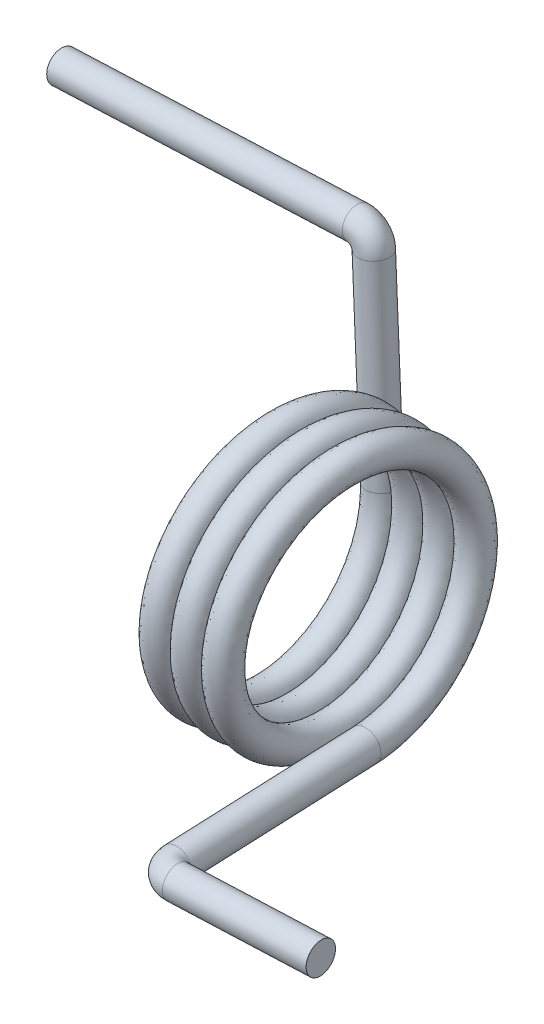
ISO-10303-21;
HEADER;
FILE_DESCRIPTION(('STEP AP214'),'2;1');
FILE_NAME('part.step','',(''),(''),'','','');
FILE_SCHEMA(('AUTOMOTIVE_DESIGN { 1 0 10303 214 1 1 1 1 }'));
ENDSEC;
DATA;
#1=APPLICATION_CONTEXT('core data for automotive mechanical design processes');
#2=APPLICATION_PROTOCOL_DEFINITION('international standard','automotive_design',2000,#1);
#3=PRODUCT_CONTEXT('',#1,'mechanical');
#4=PRODUCT('Part','Part','',(#3));
#5=PRODUCT_RELATED_PRODUCT_CATEGORY('part','',(#4));
#6=PRODUCT_DEFINITION_FORMATION('','',#4);
#7=PRODUCT_DEFINITION_CONTEXT('part definition',#1,'design');
#8=PRODUCT_DEFINITION('design','',#6,#7);
#9=PRODUCT_DEFINITION_SHAPE('','',#8);
#10=(LENGTH_UNIT() NAMED_UNIT(*) SI_UNIT(.MILLI.,.METRE.));
#11=(NAMED_UNIT(*) PLANE_ANGLE_UNIT() SI_UNIT($,.RADIAN.));
#12=(NAMED_UNIT(*) SI_UNIT($,.STERADIAN.) SOLID_ANGLE_UNIT());
#13=UNCERTAINTY_MEASURE_WITH_UNIT(LENGTH_MEASURE(1.E-05),#10,'distance_accuracy_value','');
#14=(GEOMETRIC_REPRESENTATION_CONTEXT(3) GLOBAL_UNCERTAINTY_ASSIGNED_CONTEXT((#13)) GLOBAL_UNIT_ASSIGNED_CONTEXT((#10,
#11,#12)) REPRESENTATION_CONTEXT('',''));
#15=CARTESIAN_POINT('',(0.,0.,0.));
#16=DIRECTION('',(0.,0.,1.));
#17=DIRECTION('',(1.,0.,0.));
#18=AXIS2_PLACEMENT_3D('',#15,#16,#17);
#19=CARTESIAN_POINT('',(0.989731142426947,0.0414804256276324,-7.62));
#20=CARTESIAN_POINT('',(1.15694780909361,-4.35792862559731,-7.64394873490221));
#21=CARTESIAN_POINT('',(1.32416447576028,-6.57837336402361,-3.84592310235332));
#22=CARTESIAN_POINT('',(1.49138114242695,-8.7988181024499,-0.0478974698044282));
#23=CARTESIAN_POINT('',(1.65859780909361,-6.61985378965124,3.77407689764668));
#24=CARTESIAN_POINT('',(1.82581447576028,-4.44088947685258,7.59605126509778));
#25=CARTESIAN_POINT('',(1.99303114242694,-0.0414804256276333,7.62));
#26=CARTESIAN_POINT('',(2.16024780909361,4.35792862559731,7.64394873490222));
#27=CARTESIAN_POINT('',(2.32746447576028,6.5783733640236,3.84592310235332));
#28=CARTESIAN_POINT('',(2.49468114242694,8.7988181024499,0.0478974698044293));
#29=CARTESIAN_POINT('',(2.66189780909361,6.61985378965124,-3.77407689764667));
#30=CARTESIAN_POINT('',(2.82911447576028,4.44088947685258,-7.59605126509778));
#31=CARTESIAN_POINT('',(2.99633114242694,0.0414804256276324,-7.62));
#32=CARTESIAN_POINT('',(3.16354780909361,-4.35792862559731,-7.64394873490221));
#33=CARTESIAN_POINT('',(3.33076447576028,-6.57837336402361,-3.84592310235332));
#34=CARTESIAN_POINT('',(3.49798114242694,-8.7988181024499,-0.0478974698044282));
#35=CARTESIAN_POINT('',(3.66519780909361,-6.61985378965124,3.77407689764668));
#36=CARTESIAN_POINT('',(3.83241447576027,-4.44088947685258,7.59605126509778));
#37=CARTESIAN_POINT('',(3.99963114242694,-0.0414804256276333,7.62));
#38=CARTESIAN_POINT('',(4.16684780909361,4.35792862559731,7.64394873490222));
#39=CARTESIAN_POINT('',(4.33406447576027,6.5783733640236,3.84592310235332));
#40=CARTESIAN_POINT('',(4.50128114242694,8.7988181024499,0.0478974698044293));
#41=CARTESIAN_POINT('',(4.6684978090936,6.61985378965124,-3.77407689764667));
#42=CARTESIAN_POINT('',(4.83571447576027,4.44088947685258,-7.59605126509778));
#43=CARTESIAN_POINT('',(5.00293114242694,0.0414804256276324,-7.62));
#44=CARTESIAN_POINT('',(5.1701478090936,-4.35792862559731,-7.64394873490221));
#45=CARTESIAN_POINT('',(5.33736447576027,-6.57837336402361,-3.84592310235332));
#46=CARTESIAN_POINT('',(5.50458114242694,-8.7988181024499,-0.0478974698044282));
#47=CARTESIAN_POINT('',(5.6717978090936,-6.61985378965124,3.77407689764668));
#48=CARTESIAN_POINT('',(5.83901447576027,-4.44088947685258,7.59605126509778));
#49=CARTESIAN_POINT('',(6.00623114242694,-0.0414804256276333,7.62));
#50=CARTESIAN_POINT('',(6.1734478090936,4.35792862559731,7.64394873490222));
#51=CARTESIAN_POINT('',(6.34066447576027,6.5783733640236,3.84592310235332));
#52=CARTESIAN_POINT('',(6.50788114242693,8.7988181024499,0.0478974698044293));
#53=CARTESIAN_POINT('',(6.6750978090936,6.61985378965124,-3.77407689764667));
#54=CARTESIAN_POINT('',(6.84231447576027,4.44088947685258,-7.59605126509778));
#55=CARTESIAN_POINT('',(7.00953114242693,0.0414804256276324,-7.62));
#56=CARTESIAN_POINT('',(7.1767478090936,-4.35792862559731,-7.64394873490221));
#57=CARTESIAN_POINT('',(7.34396447576027,-6.57837336402361,-3.84592310235332));
#58=CARTESIAN_POINT('',(7.51118114242693,-8.7988181024499,-0.0478974698044282));
#59=CARTESIAN_POINT('',(7.6783978090936,-6.61985378965124,3.77407689764668));
#60=CARTESIAN_POINT('',(7.84561447576026,-4.44088947685258,7.59605126509778));
#61=CARTESIAN_POINT('',(8.01283114242693,-0.0414804256276333,7.62));
#62=CARTESIAN_POINT('',(8.1800478090936,4.35792862559731,7.64394873490222));
#63=CARTESIAN_POINT('',(8.34726447576026,6.5783733640236,3.84592310235332));
#64=CARTESIAN_POINT('',(8.51448114242693,8.7988181024499,0.0478974698044293));
#65=CARTESIAN_POINT('',(8.6816978090936,6.61985378965124,-3.77407689764667));
#66=CARTESIAN_POINT('',(8.84891447576026,4.44088947685258,-7.59605126509778));
#67=CARTESIAN_POINT('',(9.01613114242693,0.0414804256276324,-7.62));
#68=CARTESIAN_POINT('',(0.989731142426947,0.0414804256276324,-5.6388));
#69=CARTESIAN_POINT('',(1.15694780909361,-3.21408227227883,-5.66274873490222));
#70=CARTESIAN_POINT('',(1.32416447576028,-4.86260383404588,-2.85532310235332));
#71=CARTESIAN_POINT('',(1.49138114242695,-6.51112539581292,-0.047897469804428));
#72=CARTESIAN_POINT('',(1.65859780909361,-4.90408425967351,2.78347689764668));
#73=CARTESIAN_POINT('',(1.82581447576028,-3.2970431235341,5.61485126509779));
#74=CARTESIAN_POINT('',(1.99303114242694,-0.0414804256276331,5.6388));
#75=CARTESIAN_POINT('',(2.16024780909361,3.21408227227883,5.66274873490222));
#76=CARTESIAN_POINT('',(2.32746447576028,4.86260383404588,2.85532310235332));
#77=CARTESIAN_POINT('',(2.49468114242694,6.51112539581292,0.0478974698044288));
#78=CARTESIAN_POINT('',(2.66189780909361,4.90408425967351,-2.78347689764668));
#79=CARTESIAN_POINT('',(2.82911447576028,3.2970431235341,-5.61485126509779));
#80=CARTESIAN_POINT('',(2.99633114242694,0.0414804256276324,-5.6388));
#81=CARTESIAN_POINT('',(3.16354780909361,-3.21408227227883,-5.66274873490222));
#82=CARTESIAN_POINT('',(3.33076447576028,-4.86260383404588,-2.85532310235332));
#83=CARTESIAN_POINT('',(3.49798114242694,-6.51112539581292,-0.047897469804428));
#84=CARTESIAN_POINT('',(3.66519780909361,-4.90408425967351,2.78347689764668));
#85=CARTESIAN_POINT('',(3.83241447576027,-3.2970431235341,5.61485126509779));
#86=CARTESIAN_POINT('',(3.99963114242694,-0.0414804256276331,5.6388));
#87=CARTESIAN_POINT('',(4.16684780909361,3.21408227227883,5.66274873490222));
#88=CARTESIAN_POINT('',(4.33406447576027,4.86260383404588,2.85532310235332));
#89=CARTESIAN_POINT('',(4.50128114242694,6.51112539581292,0.0478974698044288));
#90=CARTESIAN_POINT('',(4.6684978090936,4.90408425967351,-2.78347689764668));
#91=CARTESIAN_POINT('',(4.83571447576027,3.2970431235341,-5.61485126509779));
#92=CARTESIAN_POINT('',(5.00293114242694,0.0414804256276324,-5.6388));
#93=CARTESIAN_POINT('',(5.1701478090936,-3.21408227227883,-5.66274873490222));
#94=CARTESIAN_POINT('',(5.33736447576027,-4.86260383404588,-2.85532310235332));
#95=CARTESIAN_POINT('',(5.50458114242694,-6.51112539581292,-0.047897469804428));
#96=CARTESIAN_POINT('',(5.6717978090936,-4.90408425967351,2.78347689764668));
#97=CARTESIAN_POINT('',(5.83901447576027,-3.2970431235341,5.61485126509779));
#98=CARTESIAN_POINT('',(6.00623114242694,-0.0414804256276331,5.6388));
#99=CARTESIAN_POINT('',(6.1734478090936,3.21408227227883,5.66274873490222));
#100=CARTESIAN_POINT('',(6.34066447576027,4.86260383404588,2.85532310235332));
#101=CARTESIAN_POINT('',(6.50788114242693,6.51112539581292,0.0478974698044288));
#102=CARTESIAN_POINT('',(6.6750978090936,4.90408425967351,-2.78347689764668));
#103=CARTESIAN_POINT('',(6.84231447576027,3.2970431235341,-5.61485126509779));
#104=CARTESIAN_POINT('',(7.00953114242693,0.0414804256276324,-5.6388));
#105=CARTESIAN_POINT('',(7.1767478090936,-3.21408227227883,-5.66274873490222));
#106=CARTESIAN_POINT('',(7.34396447576027,-4.86260383404588,-2.85532310235332));
#107=CARTESIAN_POINT('',(7.51118114242693,-6.51112539581292,-0.047897469804428));
#108=CARTESIAN_POINT('',(7.6783978090936,-4.90408425967351,2.78347689764668));
#109=CARTESIAN_POINT('',(7.84561447576026,-3.2970431235341,5.61485126509779));
#110=CARTESIAN_POINT('',(8.01283114242693,-0.0414804256276331,5.6388));
#111=CARTESIAN_POINT('',(8.1800478090936,3.21408227227883,5.66274873490222));
#112=CARTESIAN_POINT('',(8.34726447576026,4.86260383404588,2.85532310235332));
#113=CARTESIAN_POINT('',(8.51448114242693,6.51112539581292,0.0478974698044288));
#114=CARTESIAN_POINT('',(8.6816978090936,4.90408425967351,-2.78347689764668));
#115=CARTESIAN_POINT('',(8.84891447576026,3.2970431235341,-5.61485126509779));
#116=CARTESIAN_POINT('',(9.01613114242693,0.0414804256276324,-5.6388));
#117=CARTESIAN_POINT('',(-0.989731142426947,-0.0414804256276324,-5.6388));
#118=CARTESIAN_POINT('',(-0.822514475760281,-3.29704312353409,-5.61485126509779));
#119=CARTESIAN_POINT('',(-0.655297809093615,-4.90408425967351,-2.78347689764668));
#120=CARTESIAN_POINT('',(-0.488081142426948,-6.51112539581292,0.0478974698044272));
#121=CARTESIAN_POINT('',(-0.320864475760282,-4.86260383404588,2.85532310235332));
#122=CARTESIAN_POINT('',(-0.153647809093616,-3.21408227227883,5.66274873490222));
#123=CARTESIAN_POINT('',(0.0135688575730504,0.0414804256276317,5.6388));
#124=CARTESIAN_POINT('',(0.180785524239717,3.29704312353409,5.61485126509779));
#125=CARTESIAN_POINT('',(0.348002190906383,4.90408425967351,2.78347689764668));
#126=CARTESIAN_POINT('',(0.515218857573049,6.51112539581292,-0.0478974698044264));
#127=CARTESIAN_POINT('',(0.682435524239716,4.86260383404588,-2.85532310235332));
#128=CARTESIAN_POINT('',(0.849652190906382,3.21408227227883,-5.66274873490221));
#129=CARTESIAN_POINT('',(1.01686885757305,-0.0414804256276324,-5.6388));
#130=CARTESIAN_POINT('',(1.18408552423971,-3.29704312353409,-5.61485126509779));
#131=CARTESIAN_POINT('',(1.35130219090638,-4.90408425967351,-2.78347689764668));
#132=CARTESIAN_POINT('',(1.51851885757305,-6.51112539581292,0.0478974698044272));
#133=CARTESIAN_POINT('',(1.68573552423971,-4.86260383404588,2.85532310235332));
#134=CARTESIAN_POINT('',(1.85295219090638,-3.21408227227883,5.66274873490222));
#135=CARTESIAN_POINT('',(2.02016885757305,0.0414804256276317,5.6388));
#136=CARTESIAN_POINT('',(2.18738552423971,3.29704312353409,5.61485126509779));
#137=CARTESIAN_POINT('',(2.35460219090638,4.90408425967351,2.78347689764668));
#138=CARTESIAN_POINT('',(2.52181885757304,6.51112539581292,-0.0478974698044264));
#139=CARTESIAN_POINT('',(2.68903552423971,4.86260383404588,-2.85532310235332));
#140=CARTESIAN_POINT('',(2.85625219090638,3.21408227227883,-5.66274873490221));
#141=CARTESIAN_POINT('',(3.02346885757304,-0.0414804256276324,-5.6388));
#142=CARTESIAN_POINT('',(3.19068552423971,-3.29704312353409,-5.61485126509779));
#143=CARTESIAN_POINT('',(3.35790219090638,-4.90408425967351,-2.78347689764668));
#144=CARTESIAN_POINT('',(3.52511885757304,-6.51112539581292,0.0478974698044272));
#145=CARTESIAN_POINT('',(3.69233552423971,-4.86260383404588,2.85532310235332));
#146=CARTESIAN_POINT('',(3.85955219090638,-3.21408227227883,5.66274873490222));
#147=CARTESIAN_POINT('',(4.02676885757304,0.0414804256276317,5.6388));
#148=CARTESIAN_POINT('',(4.19398552423971,3.29704312353409,5.61485126509779));
#149=CARTESIAN_POINT('',(4.36120219090637,4.90408425967351,2.78347689764668));
#150=CARTESIAN_POINT('',(4.52841885757304,6.51112539581292,-0.0478974698044264));
#151=CARTESIAN_POINT('',(4.69563552423971,4.86260383404588,-2.85532310235332));
#152=CARTESIAN_POINT('',(4.86285219090637,3.21408227227883,-5.66274873490221));
#153=CARTESIAN_POINT('',(5.03006885757304,-0.0414804256276324,-5.6388));
#154=CARTESIAN_POINT('',(5.1972855242397,-3.29704312353409,-5.61485126509779));
#155=CARTESIAN_POINT('',(5.36450219090637,-4.90408425967351,-2.78347689764668));
#156=CARTESIAN_POINT('',(5.53171885757304,-6.51112539581292,0.0478974698044272));
#157=CARTESIAN_POINT('',(5.6989355242397,-4.86260383404588,2.85532310235332));
#158=CARTESIAN_POINT('',(5.86615219090637,-3.21408227227883,5.66274873490222));
#159=CARTESIAN_POINT('',(6.03336885757304,0.0414804256276317,5.6388));
#160=CARTESIAN_POINT('',(6.2005855242397,3.29704312353409,5.61485126509779));
#161=CARTESIAN_POINT('',(6.36780219090637,4.90408425967351,2.78347689764668));
#162=CARTESIAN_POINT('',(6.53501885757303,6.51112539581292,-0.0478974698044264));
#163=CARTESIAN_POINT('',(6.7022355242397,4.86260383404588,-2.85532310235332));
#164=CARTESIAN_POINT('',(6.86945219090637,3.21408227227883,-5.66274873490221));
#165=CARTESIAN_POINT('',(7.03666885757303,-0.0414804256276324,-5.6388));
#166=CARTESIAN_POINT('',(-0.989731142426947,-0.0414804256276324,-7.62));
#167=CARTESIAN_POINT('',(-0.822514475760281,-4.44088947685258,-7.59605126509779));
#168=CARTESIAN_POINT('',(-0.655297809093615,-6.61985378965124,-3.77407689764668));
#169=CARTESIAN_POINT('',(-0.488081142426949,-8.7988181024499,0.0478974698044271));
#170=CARTESIAN_POINT('',(-0.320864475760282,-6.57837336402361,3.84592310235332));
#171=CARTESIAN_POINT('',(-0.153647809093616,-4.35792862559732,7.64394873490221));
#172=CARTESIAN_POINT('',(0.0135688575730502,0.0414804256276315,7.62));
#173=CARTESIAN_POINT('',(0.180785524239716,4.44088947685258,7.59605126509779));
#174=CARTESIAN_POINT('',(0.348002190906383,6.61985378965124,3.77407689764668));
#175=CARTESIAN_POINT('',(0.515218857573049,8.7988181024499,-0.047897469804426));
#176=CARTESIAN_POINT('',(0.682435524239715,6.57837336402361,-3.84592310235332));
#177=CARTESIAN_POINT('',(0.849652190906382,4.35792862559732,-7.64394873490221));
#178=CARTESIAN_POINT('',(1.01686885757305,-0.0414804256276324,-7.62));
#179=CARTESIAN_POINT('',(1.18408552423971,-4.44088947685258,-7.59605126509779));
#180=CARTESIAN_POINT('',(1.35130219090638,-6.61985378965124,-3.77407689764668));
#181=CARTESIAN_POINT('',(1.51851885757305,-8.7988181024499,0.0478974698044271));
#182=CARTESIAN_POINT('',(1.68573552423971,-6.57837336402361,3.84592310235332));
#183=CARTESIAN_POINT('',(1.85295219090638,-4.35792862559732,7.64394873490221));
#184=CARTESIAN_POINT('',(2.02016885757305,0.0414804256276315,7.62));
#185=CARTESIAN_POINT('',(2.18738552423971,4.44088947685258,7.59605126509779));
#186=CARTESIAN_POINT('',(2.35460219090638,6.61985378965124,3.77407689764668));
#187=CARTESIAN_POINT('',(2.52181885757304,8.7988181024499,-0.047897469804426));
#188=CARTESIAN_POINT('',(2.68903552423971,6.57837336402361,-3.84592310235332));
#189=CARTESIAN_POINT('',(2.85625219090638,4.35792862559732,-7.64394873490221));
#190=CARTESIAN_POINT('',(3.02346885757304,-0.0414804256276324,-7.62));
#191=CARTESIAN_POINT('',(3.19068552423971,-4.44088947685258,-7.59605126509779));
#192=CARTESIAN_POINT('',(3.35790219090638,-6.61985378965124,-3.77407689764668));
#193=CARTESIAN_POINT('',(3.52511885757304,-8.7988181024499,0.0478974698044271));
#194=CARTESIAN_POINT('',(3.69233552423971,-6.57837336402361,3.84592310235332));
#195=CARTESIAN_POINT('',(3.85955219090637,-4.35792862559732,7.64394873490221));
#196=CARTESIAN_POINT('',(4.02676885757304,0.0414804256276315,7.62));
#197=CARTESIAN_POINT('',(4.19398552423971,4.44088947685258,7.59605126509779));
#198=CARTESIAN_POINT('',(4.36120219090637,6.61985378965124,3.77407689764668));
#199=CARTESIAN_POINT('',(4.52841885757304,8.7988181024499,-0.047897469804426));
#200=CARTESIAN_POINT('',(4.69563552423971,6.57837336402361,-3.84592310235332));
#201=CARTESIAN_POINT('',(4.86285219090637,4.35792862559732,-7.64394873490221));
#202=CARTESIAN_POINT('',(5.03006885757304,-0.0414804256276324,-7.62));
#203=CARTESIAN_POINT('',(5.1972855242397,-4.44088947685258,-7.59605126509779));
#204=CARTESIAN_POINT('',(5.36450219090637,-6.61985378965124,-3.77407689764668));
#205=CARTESIAN_POINT('',(5.53171885757304,-8.7988181024499,0.0478974698044271));
#206=CARTESIAN_POINT('',(5.6989355242397,-6.57837336402361,3.84592310235332));
#207=CARTESIAN_POINT('',(5.86615219090637,-4.35792862559732,7.64394873490221));
#208=CARTESIAN_POINT('',(6.03336885757304,0.0414804256276315,7.62));
#209=CARTESIAN_POINT('',(6.2005855242397,4.44088947685258,7.59605126509779));
#210=CARTESIAN_POINT('',(6.36780219090637,6.61985378965124,3.77407689764668));
#211=CARTESIAN_POINT('',(6.53501885757303,8.7988181024499,-0.047897469804426));
#212=CARTESIAN_POINT('',(6.7022355242397,6.57837336402361,-3.84592310235332));
#213=CARTESIAN_POINT('',(6.86945219090637,4.35792862559732,-7.64394873490221));
#214=CARTESIAN_POINT('',(7.03666885757303,-0.0414804256276324,-7.62));
#215=CARTESIAN_POINT('',(-0.989731142426948,-0.0414804256276324,-9.6012));
#216=CARTESIAN_POINT('',(-0.822514475760281,-5.58473583017107,-9.57725126509779));
#217=CARTESIAN_POINT('',(-0.655297809093615,-8.33562331962897,-4.76467689764668));
#218=CARTESIAN_POINT('',(-0.488081142426949,-11.0865108090869,0.047897469804427));
#219=CARTESIAN_POINT('',(-0.320864475760283,-8.29414289400134,4.83652310235332));
#220=CARTESIAN_POINT('',(-0.153647809093616,-5.50177497891581,9.62514873490221));
#221=CARTESIAN_POINT('',(0.0135688575730499,0.0414804256276312,9.6012));
#222=CARTESIAN_POINT('',(0.180785524239716,5.58473583017106,9.57725126509779));
#223=CARTESIAN_POINT('',(0.348002190906383,8.33562331962897,4.76467689764668));
#224=CARTESIAN_POINT('',(0.515218857573049,11.0865108090869,-0.0478974698044256));
#225=CARTESIAN_POINT('',(0.682435524239715,8.29414289400134,-4.83652310235331));
#226=CARTESIAN_POINT('',(0.849652190906381,5.50177497891581,-9.62514873490221));
#227=CARTESIAN_POINT('',(1.01686885757305,-0.0414804256276324,-9.6012));
#228=CARTESIAN_POINT('',(1.18408552423971,-5.58473583017107,-9.57725126509779));
#229=CARTESIAN_POINT('',(1.35130219090638,-8.33562331962897,-4.76467689764668));
#230=CARTESIAN_POINT('',(1.51851885757305,-11.0865108090869,0.047897469804427));
#231=CARTESIAN_POINT('',(1.68573552423971,-8.29414289400134,4.83652310235332));
#232=CARTESIAN_POINT('',(1.85295219090638,-5.50177497891581,9.62514873490221));
#233=CARTESIAN_POINT('',(2.02016885757305,0.0414804256276312,9.6012));
#234=CARTESIAN_POINT('',(2.18738552423971,5.58473583017106,9.57725126509779));
#235=CARTESIAN_POINT('',(2.35460219090638,8.33562331962897,4.76467689764668));
#236=CARTESIAN_POINT('',(2.52181885757304,11.0865108090869,-0.0478974698044256));
#237=CARTESIAN_POINT('',(2.68903552423971,8.29414289400134,-4.83652310235331));
#238=CARTESIAN_POINT('',(2.85625219090638,5.50177497891581,-9.62514873490221));
#239=CARTESIAN_POINT('',(3.02346885757304,-0.0414804256276324,-9.6012));
#240=CARTESIAN_POINT('',(3.19068552423971,-5.58473583017107,-9.57725126509779));
#241=CARTESIAN_POINT('',(3.35790219090638,-8.33562331962897,-4.76467689764668));
#242=CARTESIAN_POINT('',(3.52511885757304,-11.0865108090869,0.047897469804427));
#243=CARTESIAN_POINT('',(3.69233552423971,-8.29414289400134,4.83652310235332));
#244=CARTESIAN_POINT('',(3.85955219090637,-5.50177497891581,9.62514873490221));
#245=CARTESIAN_POINT('',(4.02676885757304,0.0414804256276312,9.6012));
#246=CARTESIAN_POINT('',(4.19398552423971,5.58473583017106,9.57725126509779));
#247=CARTESIAN_POINT('',(4.36120219090637,8.33562331962897,4.76467689764668));
#248=CARTESIAN_POINT('',(4.52841885757304,11.0865108090869,-0.0478974698044256));
#249=CARTESIAN_POINT('',(4.69563552423971,8.29414289400134,-4.83652310235331));
#250=CARTESIAN_POINT('',(4.86285219090637,5.50177497891581,-9.62514873490221));
#251=CARTESIAN_POINT('',(5.03006885757304,-0.0414804256276324,-9.6012));
#252=CARTESIAN_POINT('',(5.1972855242397,-5.58473583017107,-9.57725126509779));
#253=CARTESIAN_POINT('',(5.36450219090637,-8.33562331962897,-4.76467689764668));
#254=CARTESIAN_POINT('',(5.53171885757304,-11.0865108090869,0.047897469804427));
#255=CARTESIAN_POINT('',(5.6989355242397,-8.29414289400134,4.83652310235332));
#256=CARTESIAN_POINT('',(5.86615219090637,-5.50177497891581,9.62514873490221));
#257=CARTESIAN_POINT('',(6.03336885757304,0.0414804256276312,9.6012));
#258=CARTESIAN_POINT('',(6.2005855242397,5.58473583017106,9.57725126509779));
#259=CARTESIAN_POINT('',(6.36780219090637,8.33562331962897,4.76467689764668));
#260=CARTESIAN_POINT('',(6.53501885757303,11.0865108090869,-0.0478974698044256));
#261=CARTESIAN_POINT('',(6.7022355242397,8.29414289400134,-4.83652310235331));
#262=CARTESIAN_POINT('',(6.86945219090637,5.50177497891581,-9.62514873490221));
#263=CARTESIAN_POINT('',(7.03666885757303,-0.0414804256276324,-9.6012));
#264=CARTESIAN_POINT('',(0.989731142426947,0.0414804256276324,-9.6012));
#265=CARTESIAN_POINT('',(1.15694780909361,-5.5017749789158,-9.62514873490221));
#266=CARTESIAN_POINT('',(1.32416447576028,-8.29414289400133,-4.83652310235332));
#267=CARTESIAN_POINT('',(1.49138114242695,-11.0865108090869,-0.0478974698044283));
#268=CARTESIAN_POINT('',(1.65859780909361,-8.33562331962897,4.76467689764668));
#269=CARTESIAN_POINT('',(1.82581447576028,-5.58473583017107,9.57725126509778));
#270=CARTESIAN_POINT('',(1.99303114242694,-0.0414804256276336,9.6012));
#271=CARTESIAN_POINT('',(2.16024780909361,5.5017749789158,9.62514873490221));
#272=CARTESIAN_POINT('',(2.32746447576028,8.29414289400133,4.83652310235332));
#273=CARTESIAN_POINT('',(2.49468114242694,11.0865108090869,0.0478974698044297));
#274=CARTESIAN_POINT('',(2.66189780909361,8.33562331962897,-4.76467689764667));
#275=CARTESIAN_POINT('',(2.82911447576028,5.58473583017107,-9.57725126509778));
#276=CARTESIAN_POINT('',(2.99633114242694,0.0414804256276324,-9.6012));
#277=CARTESIAN_POINT('',(3.16354780909361,-5.5017749789158,-9.62514873490221));
#278=CARTESIAN_POINT('',(3.33076447576028,-8.29414289400133,-4.83652310235332));
#279=CARTESIAN_POINT('',(3.49798114242694,-11.0865108090869,-0.0478974698044283));
#280=CARTESIAN_POINT('',(3.66519780909361,-8.33562331962897,4.76467689764668));
#281=CARTESIAN_POINT('',(3.83241447576027,-5.58473583017107,9.57725126509778));
#282=CARTESIAN_POINT('',(3.99963114242694,-0.0414804256276336,9.6012));
#283=CARTESIAN_POINT('',(4.16684780909361,5.5017749789158,9.62514873490221));
#284=CARTESIAN_POINT('',(4.33406447576027,8.29414289400133,4.83652310235332));
#285=CARTESIAN_POINT('',(4.50128114242694,11.0865108090869,0.0478974698044297));
#286=CARTESIAN_POINT('',(4.6684978090936,8.33562331962897,-4.76467689764667));
#287=CARTESIAN_POINT('',(4.83571447576027,5.58473583017107,-9.57725126509778));
#288=CARTESIAN_POINT('',(5.00293114242694,0.0414804256276324,-9.6012));
#289=CARTESIAN_POINT('',(5.1701478090936,-5.5017749789158,-9.62514873490221));
#290=CARTESIAN_POINT('',(5.33736447576027,-8.29414289400133,-4.83652310235332));
#291=CARTESIAN_POINT('',(5.50458114242694,-11.0865108090869,-0.0478974698044283));
#292=CARTESIAN_POINT('',(5.6717978090936,-8.33562331962897,4.76467689764668));
#293=CARTESIAN_POINT('',(5.83901447576027,-5.58473583017107,9.57725126509778));
#294=CARTESIAN_POINT('',(6.00623114242694,-0.0414804256276336,9.6012));
#295=CARTESIAN_POINT('',(6.1734478090936,5.5017749789158,9.62514873490221));
#296=CARTESIAN_POINT('',(6.34066447576027,8.29414289400133,4.83652310235332));
#297=CARTESIAN_POINT('',(6.50788114242693,11.0865108090869,0.0478974698044297));
#298=CARTESIAN_POINT('',(6.6750978090936,8.33562331962897,-4.76467689764667));
#299=CARTESIAN_POINT('',(6.84231447576027,5.58473583017107,-9.57725126509778));
#300=CARTESIAN_POINT('',(7.00953114242693,0.0414804256276324,-9.6012));
#301=CARTESIAN_POINT('',(7.1767478090936,-5.5017749789158,-9.62514873490221));
#302=CARTESIAN_POINT('',(7.34396447576027,-8.29414289400133,-4.83652310235332));
#303=CARTESIAN_POINT('',(7.51118114242693,-11.0865108090869,-0.0478974698044283));
#304=CARTESIAN_POINT('',(7.6783978090936,-8.33562331962897,4.76467689764668));
#305=CARTESIAN_POINT('',(7.84561447576026,-5.58473583017107,9.57725126509778));
#306=CARTESIAN_POINT('',(8.01283114242693,-0.0414804256276336,9.6012));
#307=CARTESIAN_POINT('',(8.1800478090936,5.5017749789158,9.62514873490221));
#308=CARTESIAN_POINT('',(8.34726447576026,8.29414289400133,4.83652310235332));
#309=CARTESIAN_POINT('',(8.51448114242693,11.0865108090869,0.0478974698044297));
#310=CARTESIAN_POINT('',(8.6816978090936,8.33562331962897,-4.76467689764667));
#311=CARTESIAN_POINT('',(8.84891447576026,5.58473583017107,-9.57725126509778));
#312=CARTESIAN_POINT('',(9.01613114242693,0.0414804256276324,-9.6012));
#313=CARTESIAN_POINT('',(0.989731142426947,0.0414804256276324,-7.62));
#314=CARTESIAN_POINT('',(1.15694780909361,-4.35792862559731,-7.64394873490221));
#315=CARTESIAN_POINT('',(1.32416447576028,-6.57837336402361,-3.84592310235332));
#316=CARTESIAN_POINT('',(1.49138114242695,-8.7988181024499,-0.0478974698044282));
#317=CARTESIAN_POINT('',(1.65859780909361,-6.61985378965124,3.77407689764668));
#318=CARTESIAN_POINT('',(1.82581447576028,-4.44088947685258,7.59605126509778));
#319=CARTESIAN_POINT('',(1.99303114242694,-0.0414804256276333,7.62));
#320=CARTESIAN_POINT('',(2.16024780909361,4.35792862559731,7.64394873490222));
#321=CARTESIAN_POINT('',(2.32746447576028,6.5783733640236,3.84592310235332));
#322=CARTESIAN_POINT('',(2.49468114242694,8.7988181024499,0.0478974698044293));
#323=CARTESIAN_POINT('',(2.66189780909361,6.61985378965124,-3.77407689764667));
#324=CARTESIAN_POINT('',(2.82911447576028,4.44088947685258,-7.59605126509778));
#325=CARTESIAN_POINT('',(2.99633114242694,0.0414804256276324,-7.62));
#326=CARTESIAN_POINT('',(3.16354780909361,-4.35792862559731,-7.64394873490221));
#327=CARTESIAN_POINT('',(3.33076447576028,-6.57837336402361,-3.84592310235332));
#328=CARTESIAN_POINT('',(3.49798114242694,-8.7988181024499,-0.0478974698044282));
#329=CARTESIAN_POINT('',(3.66519780909361,-6.61985378965124,3.77407689764668));
#330=CARTESIAN_POINT('',(3.83241447576027,-4.44088947685258,7.59605126509778));
#331=CARTESIAN_POINT('',(3.99963114242694,-0.0414804256276333,7.62));
#332=CARTESIAN_POINT('',(4.16684780909361,4.35792862559731,7.64394873490222));
#333=CARTESIAN_POINT('',(4.33406447576027,6.5783733640236,3.84592310235332));
#334=CARTESIAN_POINT('',(4.50128114242694,8.7988181024499,0.0478974698044293));
#335=CARTESIAN_POINT('',(4.6684978090936,6.61985378965124,-3.77407689764667));
#336=CARTESIAN_POINT('',(4.83571447576027,4.44088947685258,-7.59605126509778));
#337=CARTESIAN_POINT('',(5.00293114242694,0.0414804256276324,-7.62));
#338=CARTESIAN_POINT('',(5.1701478090936,-4.35792862559731,-7.64394873490221));
#339=CARTESIAN_POINT('',(5.33736447576027,-6.57837336402361,-3.84592310235332));
#340=CARTESIAN_POINT('',(5.50458114242694,-8.7988181024499,-0.0478974698044282));
#341=CARTESIAN_POINT('',(5.6717978090936,-6.61985378965124,3.77407689764668));
#342=CARTESIAN_POINT('',(5.83901447576027,-4.44088947685258,7.59605126509778));
#343=CARTESIAN_POINT('',(6.00623114242694,-0.0414804256276333,7.62));
#344=CARTESIAN_POINT('',(6.1734478090936,4.35792862559731,7.64394873490222));
#345=CARTESIAN_POINT('',(6.34066447576027,6.5783733640236,3.84592310235332));
#346=CARTESIAN_POINT('',(6.50788114242693,8.7988181024499,0.0478974698044293));
#347=CARTESIAN_POINT('',(6.6750978090936,6.61985378965124,-3.77407689764667));
#348=CARTESIAN_POINT('',(6.84231447576027,4.44088947685258,-7.59605126509778));
#349=CARTESIAN_POINT('',(7.00953114242693,0.0414804256276324,-7.62));
#350=CARTESIAN_POINT('',(7.1767478090936,-4.35792862559731,-7.64394873490221));
#351=CARTESIAN_POINT('',(7.34396447576027,-6.57837336402361,-3.84592310235332));
#352=CARTESIAN_POINT('',(7.51118114242693,-8.7988181024499,-0.0478974698044282));
#353=CARTESIAN_POINT('',(7.6783978090936,-6.61985378965124,3.77407689764668));
#354=CARTESIAN_POINT('',(7.84561447576026,-4.44088947685258,7.59605126509778));
#355=CARTESIAN_POINT('',(8.01283114242693,-0.0414804256276333,7.62));
#356=CARTESIAN_POINT('',(8.1800478090936,4.35792862559731,7.64394873490222));
#357=CARTESIAN_POINT('',(8.34726447576026,6.5783733640236,3.84592310235332));
#358=CARTESIAN_POINT('',(8.51448114242693,8.7988181024499,0.0478974698044293));
#359=CARTESIAN_POINT('',(8.6816978090936,6.61985378965124,-3.77407689764667));
#360=CARTESIAN_POINT('',(8.84891447576026,4.44088947685258,-7.59605126509778));
#361=CARTESIAN_POINT('',(9.01613114242693,0.0414804256276324,-7.62));
#362=(BOUNDED_SURFACE() B_SPLINE_SURFACE(3,2,((#19,#20,#21,#22,#23,#24,#25,#26,#27,#28,#29,#30,
#31,#32,#33,#34,#35,#36,#37,#38,#39,#40,#41,#42,#43,#44,#45,#46,#47,#48,#49,#50,#51,#52,#53,#54,
#55,#56,#57,#58,#59,#60,#61,#62,#63,#64,#65,#66,#67),(#68,#69,#70,#71,#72,#73,#74,#75,#76,#77,
#78,#79,#80,#81,#82,#83,#84,#85,#86,#87,#88,#89,#90,#91,#92,#93,#94,#95,#96,#97,#98,#99,#100,
#101,#102,#103,#104,#105,#106,#107,#108,#109,#110,#111,#112,#113,#114,#115,#116),(#117,#118,
#119,#120,#121,#122,#123,#124,#125,#126,#127,#128,#129,#130,#131,#132,#133,#134,#135,#136,#137,
#138,#139,#140,#141,#142,#143,#144,#145,#146,#147,#148,#149,#150,#151,#152,#153,#154,#155,#156,
#157,#158,#159,#160,#161,#162,#163,#164,#165),(#166,#167,#168,#169,#170,#171,#172,#173,#174,
#175,#176,#177,#178,#179,#180,#181,#182,#183,#184,#185,#186,#187,#188,#189,#190,#191,#192,#193,
#194,#195,#196,#197,#198,#199,#200,#201,#202,#203,#204,#205,#206,#207,#208,#209,#210,#211,#212,
#213,#214),(#215,#216,#217,#218,#219,#220,#221,#222,#223,#224,#225,#226,#227,#228,#229,#230,
#231,#232,#233,#234,#235,#236,#237,#238,#239,#240,#241,#242,#243,#244,#245,#246,#247,#248,#249,
#250,#251,#252,#253,#254,#255,#256,#257,#258,#259,#260,#261,#262,#263),(#264,#265,#266,#267,
#268,#269,#270,#271,#272,#273,#274,#275,#276,#277,#278,#279,#280,#281,#282,#283,#284,#285,#286,
#287,#288,#289,#290,#291,#292,#293,#294,#295,#296,#297,#298,#299,#300,#301,#302,#303,#304,#305,
#306,#307,#308,#309,#310,#311,#312),(#313,#314,#315,#316,#317,#318,#319,#320,#321,#322,#323,
#324,#325,#326,#327,#328,#329,#330,#331,#332,#333,#334,#335,#336,#337,#338,#339,#340,#341,#342,
#343,#344,#345,#346,#347,#348,#349,#350,#351,#352,#353,#354,#355,#356,#357,#358,#359,#360,
#361)),.UNSPECIFIED.,.T.,.F.,.F.) B_SPLINE_SURFACE_WITH_KNOTS((4,3,4),(3,2,2,2,2,2,2,2,2,2,2,2,
2,2,2,2,2,2,2,2,2,2,2,2,3),(0.,0.5,1.),(0.,0.0416666666666667,0.0833333333333333,0.125,
0.166666666666667,0.208333333333333,0.25,0.291666666666667,0.333333333333333,0.375,
0.416666666666667,0.458333333333333,0.5,0.541666666666667,0.583333333333333,0.625,
0.666666666666667,0.708333333333333,0.75,0.791666666666667,0.833333333333333,0.875,
0.916666666666667,0.958333333333333,1.),
.UNSPECIFIED.) GEOMETRIC_REPRESENTATION_ITEM() RATIONAL_B_SPLINE_SURFACE(((1.,0.866025403784439,
1.,0.866025403784439,1.,0.866025403784439,1.,0.866025403784439,1.,0.866025403784439,1.,
0.866025403784439,1.,0.866025403784439,1.,0.866025403784439,1.,0.866025403784439,1.,
0.866025403784439,1.,0.866025403784439,1.,0.866025403784439,1.,0.866025403784439,1.,
0.866025403784439,1.,0.866025403784439,1.,0.866025403784439,1.,0.866025403784439,1.,
0.866025403784439,1.,0.866025403784439,1.,0.866025403784439,1.,0.866025403784439,1.,
0.866025403784439,1.,0.866025403784439,1.,0.866025403784439,1.),(0.333333333333333,
0.288675134594813,0.333333333333333,0.288675134594813,0.333333333333333,0.288675134594813,
0.333333333333333,0.288675134594813,0.333333333333333,0.288675134594813,0.333333333333333,
0.288675134594813,0.333333333333333,0.288675134594813,0.333333333333333,0.288675134594813,
0.333333333333333,0.288675134594813,0.333333333333333,0.288675134594813,0.333333333333333,
0.288675134594813,0.333333333333333,0.288675134594813,0.333333333333333,0.288675134594813,
0.333333333333333,0.288675134594813,0.333333333333333,0.288675134594813,0.333333333333333,
0.288675134594813,0.333333333333333,0.288675134594813,0.333333333333333,0.288675134594813,
0.333333333333333,0.288675134594813,0.333333333333333,0.288675134594813,0.333333333333333,
0.288675134594813,0.333333333333333,0.288675134594813,0.333333333333333,0.288675134594813,
0.333333333333333,0.288675134594813,0.333333333333333),(0.333333333333333,0.288675134594813,
0.333333333333333,0.288675134594813,0.333333333333333,0.288675134594813,0.333333333333333,
0.288675134594813,0.333333333333333,0.288675134594813,0.333333333333333,0.288675134594813,
0.333333333333333,0.288675134594813,0.333333333333333,0.288675134594813,0.333333333333333,
0.288675134594813,0.333333333333333,0.288675134594813,0.333333333333333,0.288675134594813,
0.333333333333333,0.288675134594813,0.333333333333333,0.288675134594813,0.333333333333333,
0.288675134594813,0.333333333333333,0.288675134594813,0.333333333333333,0.288675134594813,
0.333333333333333,0.288675134594813,0.333333333333333,0.288675134594813,0.333333333333333,
0.288675134594813,0.333333333333333,0.288675134594813,0.333333333333333,0.288675134594813,
0.333333333333333,0.288675134594813,0.333333333333333,0.288675134594813,0.333333333333333,
0.288675134594813,0.333333333333333),(1.,0.866025403784439,1.,0.866025403784439,1.,
0.866025403784439,1.,0.866025403784439,1.,0.866025403784439,1.,0.866025403784439,1.,
0.866025403784439,1.,0.866025403784439,1.,0.866025403784439,1.,0.866025403784439,1.,
0.866025403784439,1.,0.866025403784439,1.,0.866025403784439,1.,0.866025403784439,1.,
0.866025403784439,1.,0.866025403784439,1.,0.866025403784439,1.,0.866025403784439,1.,
0.866025403784439,1.,0.866025403784439,1.,0.866025403784439,1.,0.866025403784439,1.,
0.866025403784439,1.,0.866025403784439,1.),(0.333333333333333,0.288675134594813,
0.333333333333333,0.288675134594813,0.333333333333333,0.288675134594813,0.333333333333333,
0.288675134594813,0.333333333333333,0.288675134594813,0.333333333333333,0.288675134594813,
0.333333333333333,0.288675134594813,0.333333333333333,0.288675134594813,0.333333333333333,
0.288675134594813,0.333333333333333,0.288675134594813,0.333333333333333,0.288675134594813,
0.333333333333333,0.288675134594813,0.333333333333333,0.288675134594813,0.333333333333333,
0.288675134594813,0.333333333333333,0.288675134594813,0.333333333333333,0.288675134594813,
0.333333333333333,0.288675134594813,0.333333333333333,0.288675134594813,0.333333333333333,
0.288675134594813,0.333333333333333,0.288675134594813,0.333333333333333,0.288675134594813,
0.333333333333333,0.288675134594813,0.333333333333333,0.288675134594813,0.333333333333333,
0.288675134594813,0.333333333333333),(0.333333333333333,0.288675134594813,0.333333333333333,
0.288675134594813,0.333333333333333,0.288675134594813,0.333333333333333,0.288675134594813,
0.333333333333333,0.288675134594813,0.333333333333333,0.288675134594813,0.333333333333333,
0.288675134594813,0.333333333333333,0.288675134594813,0.333333333333333,0.288675134594813,
0.333333333333333,0.288675134594813,0.333333333333333,0.288675134594813,0.333333333333333,
0.288675134594813,0.333333333333333,0.288675134594813,0.333333333333333,0.288675134594813,
0.333333333333333,0.288675134594813,0.333333333333333,0.288675134594813,0.333333333333333,
0.288675134594813,0.333333333333333,0.288675134594813,0.333333333333333,0.288675134594813,
0.333333333333333,0.288675134594813,0.333333333333333,0.288675134594813,0.333333333333333,
0.288675134594813,0.333333333333333,0.288675134594813,0.333333333333333,0.288675134594813,
0.333333333333333),(1.,0.866025403784439,1.,0.866025403784439,1.,0.866025403784439,1.,
0.866025403784439,1.,0.866025403784439,1.,0.866025403784439,1.,0.866025403784439,1.,
0.866025403784439,1.,0.866025403784439,1.,0.866025403784439,1.,0.866025403784439,1.,
0.866025403784439,1.,0.866025403784439,1.,0.866025403784439,1.,0.866025403784439,1.,
0.866025403784439,1.,0.866025403784439,1.,0.866025403784439,1.,0.866025403784439,1.,
0.866025403784439,1.,0.866025403784439,1.,0.866025403784439,1.,0.866025403784439,1.,
0.866025403784439,1.))) REPRESENTATION_ITEM('') SURFACE());
#363=CARTESIAN_POINT('',(6.52145,-7.62,3.59401980542031E-13));
#364=DIRECTION('',(0.0418740416188496,0.,0.999122897664998));
#365=DIRECTION('',(0.999122897664998,0.,-0.0418740416188496));
#366=AXIS2_PLACEMENT_3D('',#363,#364,#365);
#367=CIRCLE('',#366,0.9906);
#368=CARTESIAN_POINT('',(7.51118114242695,-7.62,-0.041480425627273));
#369=VERTEX_POINT('',#368);
#370=EDGE_CURVE('E43',#369,#369,#367,.T.);
#371=CARTESIAN_POINT('',(0.,0.,-7.62));
#372=DIRECTION('',(0.0418740416188496,-0.999122897664998,0.));
#373=DIRECTION('',(0.999122897664998,0.0418740416188496,0.));
#374=AXIS2_PLACEMENT_3D('',#371,#372,#373);
#375=CIRCLE('',#374,0.9906);
#376=CARTESIAN_POINT('',(0.989731142426947,0.0414804256276324,-7.62));
#377=VERTEX_POINT('',#376);
#378=EDGE_CURVE('E59',#377,#377,#375,.T.);
#379=ORIENTED_EDGE('',*,*,#370,.F.);
#380=EDGE_LOOP('',(#379));
#381=FACE_BOUND('',#380,.T.);
#382=ORIENTED_EDGE('',*,*,#378,.T.);
#383=EDGE_LOOP('',(#382));
#384=FACE_BOUND('',#383,.T.);
#385=ADVANCED_FACE('F34',(#381,#384),#362,.T.);
#386=CARTESIAN_POINT('',(-0.53180032855939,12.6888608003455,-7.62));
#387=DIRECTION('',(0.0418740416188496,-0.999122897664998,0.));
#388=DIRECTION('',(0.999122897664999,0.0418740416188496,0.));
#389=AXIS2_PLACEMENT_3D('',#386,#387,#388);
#390=CYLINDRICAL_SURFACE('',#389,0.990600000000001);
#391=CARTESIAN_POINT('',(-0.53180032855939,12.6888608003455,-7.62));
#392=DIRECTION('',(-0.0418740416188496,0.999122897664999,0.));
#393=DIRECTION('',(-0.999122897664999,-0.0418740416188496,0.));
#394=AXIS2_PLACEMENT_3D('',#391,#392,#393);
#395=CIRCLE('',#394,0.990600000000001);
#396=CARTESIAN_POINT('',(-0.52628989554031,12.6890917468814,-6.62941535354537));
#397=VERTEX_POINT('',#396);
#398=CARTESIAN_POINT('',(-0.526289895543862,12.6890917470108,-8.61058464645462));
#399=VERTEX_POINT('',#398);
#400=EDGE_CURVE('E52',#397,#399,#395,.T.);
#401=ORIENTED_EDGE('',*,*,#400,.F.);
#402=EDGE_CURVE('E55',#399,#397,#395,.T.);
#403=ORIENTED_EDGE('',*,*,#402,.F.);
#404=EDGE_LOOP('',(#401,#403));
#405=FACE_BOUND('',#404,.T.);
#406=ORIENTED_EDGE('',*,*,#378,.F.);
#407=EDGE_LOOP('',(#406));
#408=FACE_BOUND('',#407,.T.);
#409=ADVANCED_FACE('F53',(#405,#408),#390,.T.);
#410=CARTESIAN_POINT('',(-0.53180032855939,12.6888608003455,-7.62));
#411=DIRECTION('',(-0.0418740416188496,0.999122897664999,0.));
#412=DIRECTION('',(-0.999122897664999,-0.0418740416188496,0.));
#413=AXIS2_PLACEMENT_3D('',#410,#411,#412);
#414=PLANE('',#413);
#415=CARTESIAN_POINT('',(-0.520779462530551,12.689322693676,-7.61999999999999));
#416=DIRECTION('',(-0.0418740416188457,0.999122897664999,1.30662272638695E-10));
#417=DIRECTION('',(-0.999122897664999,-0.0418740416188457,-9.40704563540775E-13));
#418=AXIS2_PLACEMENT_3D('',#415,#416,#417);
#419=CIRCLE('',#418,0.990599999999999);
#420=EDGE_CURVE('E11',#399,#397,#419,.T.);
#421=ORIENTED_EDGE('',*,*,#420,.F.);
#422=ORIENTED_EDGE('',*,*,#402,.T.);
#423=EDGE_LOOP('',(#421,#422));
#424=FACE_BOUND('',#423,.T.);
#425=ADVANCED_FACE('F61',(#424),#414,.T.);
#426=CARTESIAN_POINT('',(-0.520779462530551,12.689322693676,-7.61999999999999));
#427=DIRECTION('',(-0.0418740416188457,0.999122897664999,1.30662272638695E-10));
#428=DIRECTION('',(-0.999122897664999,-0.0418740416188457,-9.40704563540775E-13));
#429=AXIS2_PLACEMENT_3D('',#426,#427,#428);
#430=PLANE('',#429);
#431=CARTESIAN_POINT('',(-0.520779462530551,12.689322693676,-7.61999999999999));
#432=DIRECTION('',(-0.0418740416188457,0.999122897664999,1.30662272638695E-10));
#433=DIRECTION('',(-0.999122897664999,-0.0418740416188457,-9.40704563540775E-13));
#434=AXIS2_PLACEMENT_3D('',#431,#432,#433);
#435=CIRCLE('',#434,0.990599999999999);
#436=EDGE_CURVE('E62',#397,#399,#435,.T.);
#437=ORIENTED_EDGE('',*,*,#436,.F.);
#438=ORIENTED_EDGE('',*,*,#400,.T.);
#439=EDGE_LOOP('',(#437,#438));
#440=FACE_BOUND('',#439,.T.);
#441=ADVANCED_FACE('F66',(#440),#430,.F.);
#442=CARTESIAN_POINT('',(-1.52901075243558,12.6542579488405,-7.62000000006519));
#443=DIRECTION('',(-6.30277907915986E-11,-6.7559268764713E-11,1.));
#444=AXIS1_PLACEMENT('',#442,#443);
#445=SURFACE_OF_REVOLUTION('',#435,#444);
#446=ORIENTED_EDGE('',*,*,#436,.T.);
#447=ORIENTED_EDGE('',*,*,#420,.T.);
#448=EDGE_LOOP('',(#446,#447));
#449=FACE_BOUND('',#448,.T.);
#450=CARTESIAN_POINT('',(-1.56407549727109,13.6624892387455,-7.62));
#451=DIRECTION('',(-0.999122897664999,-0.0418740416188496,0.));
#452=DIRECTION('',(0.0418740416188496,-0.999122897664999,0.));
#453=AXIS2_PLACEMENT_3D('',#450,#451,#452);
#454=CIRCLE('',#453,0.990599999999999);
#455=CARTESIAN_POINT('',(-1.52259507164346,12.6727580963185,-7.62));
#456=VERTEX_POINT('',#455);
#457=EDGE_CURVE('E67',#456,#456,#454,.T.);
#458=ORIENTED_EDGE('',*,*,#457,.F.);
#459=EDGE_LOOP('',(#458));
#460=FACE_BOUND('',#459,.T.);
#461=ADVANCED_FACE('F64',(#449,#460),#445,.F.);
#462=CARTESIAN_POINT('',(-20.5973666977893,12.8647887459064,-7.62));
#463=DIRECTION('',(0.999122897664998,0.0418740416188496,0.));
#464=DIRECTION('',(-0.0418740416188496,0.999122897664998,0.));
#465=AXIS2_PLACEMENT_3D('',#462,#463,#464);
#466=CYLINDRICAL_SURFACE('',#465,0.990599999999999);
#467=CARTESIAN_POINT('',(-20.5973666977893,12.8647887459064,-7.62));
#468=DIRECTION('',(-0.999122897664999,-0.0418740416188496,0.));
#469=DIRECTION('',(0.0418740416188496,-0.999122897664999,0.));
#470=AXIS2_PLACEMENT_3D('',#467,#468,#469);
#471=CIRCLE('',#470,0.990599999999999);
#472=CARTESIAN_POINT('',(-20.5558862721617,11.8750576034795,-7.62));
#473=VERTEX_POINT('',#472);
#474=EDGE_CURVE('E70',#473,#473,#471,.T.);
#475=ORIENTED_EDGE('',*,*,#474,.F.);
#476=EDGE_LOOP('',(#475));
#477=FACE_BOUND('',#476,.T.);
#478=ORIENTED_EDGE('',*,*,#457,.T.);
#479=EDGE_LOOP('',(#478));
#480=FACE_BOUND('',#479,.T.);
#481=ADVANCED_FACE('F79',(#477,#480),#466,.T.);
#482=CARTESIAN_POINT('',(-20.5973666977893,12.8647887459064,-7.62));
#483=DIRECTION('',(-0.999122897664999,-0.0418740416188496,0.));
#484=DIRECTION('',(0.0418740416188496,-0.999122897664999,0.));
#485=AXIS2_PLACEMENT_3D('',#482,#483,#484);
#486=PLANE('',#485);
#487=ORIENTED_EDGE('',*,*,#474,.T.);
#488=EDGE_LOOP('',(#487));
#489=FACE_BOUND('',#488,.T.);
#490=ADVANCED_FACE('F98',(#489),#486,.T.);
#491=CARTESIAN_POINT('',(7.05325032855939,-7.6199999999994,12.6888608003458));
#492=DIRECTION('',(-0.0418740416188496,0.,-0.999122897664998));
#493=DIRECTION('',(-0.999122897664999,0.,0.0418740416188496));
#494=AXIS2_PLACEMENT_3D('',#491,#492,#493);
#495=CYLINDRICAL_SURFACE('',#494,0.990599999999998);
#496=CARTESIAN_POINT('',(7.05325032855939,-7.6199999999994,12.6888608003458));
#497=DIRECTION('',(0.0418740416188496,0.,0.999122897664999));
#498=DIRECTION('',(0.999122897664999,0.,-0.0418740416188496));
#499=AXIS2_PLACEMENT_3D('',#496,#497,#498);
#500=CIRCLE('',#499,0.990599999999998);
#501=CARTESIAN_POINT('',(8.04298147098634,-7.6199999999994,12.6473803747182));
#502=VERTEX_POINT('',#501);
#503=EDGE_CURVE('E121',#502,#502,#500,.T.);
#504=ORIENTED_EDGE('',*,*,#503,.F.);
#505=EDGE_LOOP('',(#504));
#506=FACE_BOUND('',#505,.T.);
#507=ORIENTED_EDGE('',*,*,#370,.T.);
#508=EDGE_LOOP('',(#507));
#509=FACE_BOUND('',#508,.T.);
#510=ADVANCED_FACE('F95',(#506,#509),#495,.T.);
#511=CARTESIAN_POINT('',(7.05325032855939,-7.6199999999994,12.6888608003458));
#512=DIRECTION('',(0.0418740416188461,1.01696762795852E-10,0.999122897664999));
#513=DIRECTION('',(0.999122897664999,-1.28937089965172E-12,-0.0418740416188461));
#514=AXIS2_PLACEMENT_3D('',#511,#512,#513);
#515=CIRCLE('',#514,0.990599999999999);
#516=CARTESIAN_POINT('',(8.05620213211524,-7.62000000005043,12.65953743519));
#517=DIRECTION('',(4.93456705050327E-11,1.,-5.23158849934234E-11));
#518=AXIS1_PLACEMENT('',#516,#517);
#519=SURFACE_OF_REVOLUTION('',#515,#518);
#520=ORIENTED_EDGE('',*,*,#503,.T.);
#521=EDGE_LOOP('',(#520));
#522=FACE_BOUND('',#521,.T.);
#523=CARTESIAN_POINT('',(8.08552549727109,-7.6199999999994,13.6624892387458));
#524=DIRECTION('',(0.999122897664999,0.,-0.0418740416188496));
#525=DIRECTION('',(-0.0418740416188496,0.,-0.999122897664999));
#526=AXIS2_PLACEMENT_3D('',#523,#524,#525);
#527=CIRCLE('',#526,0.990599999999999);
#528=CARTESIAN_POINT('',(8.04404507164346,-7.6199999999994,12.6727580963189));
#529=VERTEX_POINT('',#528);
#530=EDGE_CURVE('E123',#529,#529,#527,.T.);
#531=ORIENTED_EDGE('',*,*,#530,.F.);
#532=EDGE_LOOP('',(#531));
#533=FACE_BOUND('',#532,.T.);
#534=ADVANCED_FACE('F97',(#522,#533),#519,.F.);
#535=CARTESIAN_POINT('',(16.9677280575129,-7.6199999999994,13.2902290087543));
#536=DIRECTION('',(-0.999122897664998,0.,0.0418740416188496));
#537=DIRECTION('',(0.0418740416188496,0.,0.999122897664999));
#538=AXIS2_PLACEMENT_3D('',#535,#536,#537);
#539=CYLINDRICAL_SURFACE('',#538,0.990599999999999);
#540=CARTESIAN_POINT('',(16.9677280575129,-7.6199999999994,13.2902290087543));
#541=DIRECTION('',(0.999122897664999,0.,-0.0418740416188496));
#542=DIRECTION('',(-0.0418740416188496,0.,-0.999122897664999));
#543=AXIS2_PLACEMENT_3D('',#540,#541,#542);
#544=CIRCLE('',#543,0.990599999999999);
#545=CARTESIAN_POINT('',(16.9262476318853,-7.6199999999994,12.3004978663273));
#546=VERTEX_POINT('',#545);
#547=EDGE_CURVE('E129',#546,#546,#544,.T.);
#548=ORIENTED_EDGE('',*,*,#547,.F.);
#549=EDGE_LOOP('',(#548));
#550=FACE_BOUND('',#549,.T.);
#551=ORIENTED_EDGE('',*,*,#530,.T.);
#552=EDGE_LOOP('',(#551));
#553=FACE_BOUND('',#552,.T.);
#554=ADVANCED_FACE('F105',(#550,#553),#539,.T.);
#555=CARTESIAN_POINT('',(16.9677280575129,-7.6199999999994,13.2902290087543));
#556=DIRECTION('',(0.999122897664999,0.,-0.0418740416188496));
#557=DIRECTION('',(-0.0418740416188496,0.,-0.999122897664999));
#558=AXIS2_PLACEMENT_3D('',#555,#556,#557);
#559=PLANE('',#558);
#560=ORIENTED_EDGE('',*,*,#547,.T.);
#561=EDGE_LOOP('',(#560));
#562=FACE_BOUND('',#561,.T.);
#563=ADVANCED_FACE('F133',(#562),#559,.T.);
#564=CLOSED_SHELL('',(#385,#409,#425,#441,#461,#481,#490,#510,#534,#554,#563));
#565=MANIFOLD_SOLID_BREP('B2',#564);
#566=ADVANCED_BREP_SHAPE_REPRESENTATION('',(#18,#565),#14);
#567=SHAPE_DEFINITION_REPRESENTATION(#9,#566);
ENDSEC;
END-ISO-10303-21;
